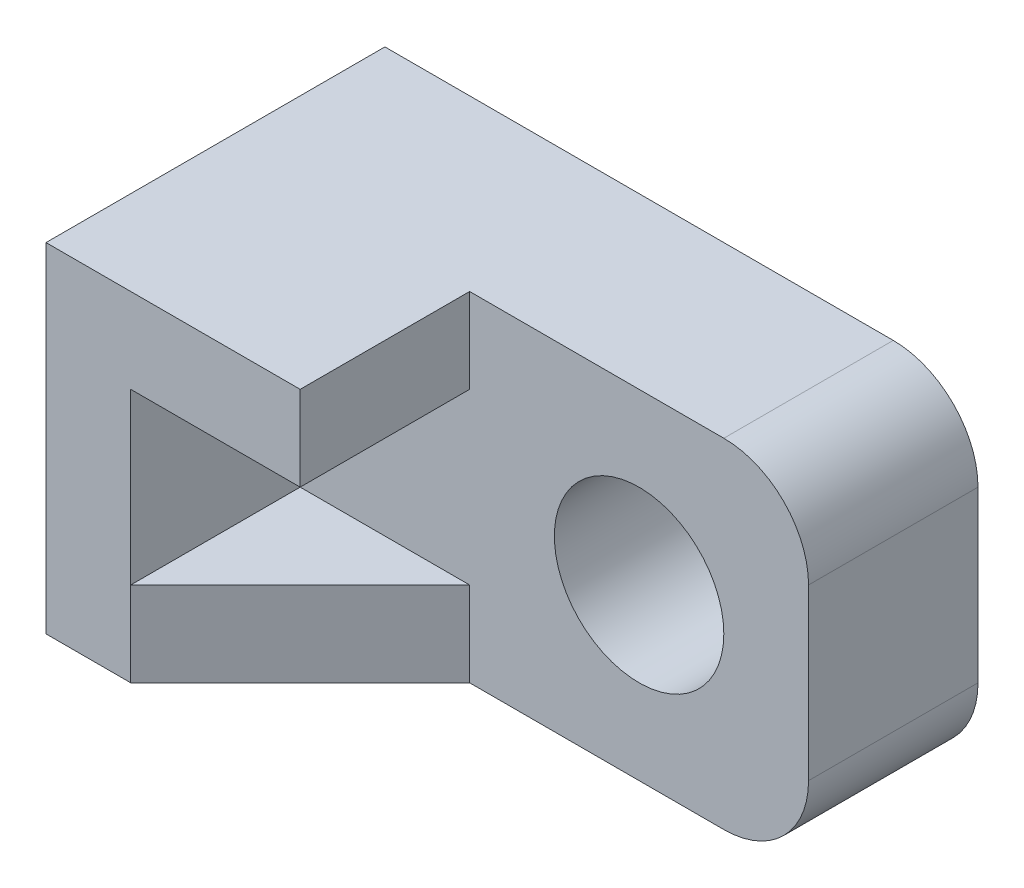
ISO-10303-21;
HEADER;
FILE_DESCRIPTION(('STEP AP214'),'2;1');
FILE_NAME('part.step','',(''),(''),'','','');
FILE_SCHEMA(('AUTOMOTIVE_DESIGN { 1 0 10303 214 1 1 1 1 }'));
ENDSEC;
DATA;
#1=APPLICATION_CONTEXT('core data for automotive mechanical design processes');
#2=APPLICATION_PROTOCOL_DEFINITION('international standard','automotive_design',2000,#1);
#3=PRODUCT_CONTEXT('',#1,'mechanical');
#4=PRODUCT('Part','Part','',(#3));
#5=PRODUCT_RELATED_PRODUCT_CATEGORY('part','',(#4));
#6=PRODUCT_DEFINITION_FORMATION('','',#4);
#7=PRODUCT_DEFINITION_CONTEXT('part definition',#1,'design');
#8=PRODUCT_DEFINITION('design','',#6,#7);
#9=PRODUCT_DEFINITION_SHAPE('','',#8);
#10=(LENGTH_UNIT() NAMED_UNIT(*) SI_UNIT(.MILLI.,.METRE.));
#11=(NAMED_UNIT(*) PLANE_ANGLE_UNIT() SI_UNIT($,.RADIAN.));
#12=(NAMED_UNIT(*) SI_UNIT($,.STERADIAN.) SOLID_ANGLE_UNIT());
#13=UNCERTAINTY_MEASURE_WITH_UNIT(LENGTH_MEASURE(1.E-05),#10,'distance_accuracy_value','');
#14=(GEOMETRIC_REPRESENTATION_CONTEXT(3) GLOBAL_UNCERTAINTY_ASSIGNED_CONTEXT((#13)) GLOBAL_UNIT_ASSIGNED_CONTEXT((#10,
#11,#12)) REPRESENTATION_CONTEXT('',''));
#15=CARTESIAN_POINT('',(0.,0.,0.));
#16=DIRECTION('',(0.,0.,1.));
#17=DIRECTION('',(1.,0.,0.));
#18=AXIS2_PLACEMENT_3D('',#15,#16,#17);
#19=CARTESIAN_POINT('',(0.,-1016.,1016.));
#20=DIRECTION('',(0.,1.,0.));
#21=DIRECTION('',(0.,0.,1.));
#22=AXIS2_PLACEMENT_3D('',#19,#20,#21);
#23=PLANE('',#22);
#24=DIRECTION('',(0.707106781186548,0.,-0.707106781186547));
#25=VECTOR('',#24,1.);
#26=CARTESIAN_POINT('',(254.,-1016.,1016.));
#27=LINE('',#26,#25);
#28=CARTESIAN_POINT('',(254.,-1016.,1016.));
#29=VERTEX_POINT('',#28);
#30=CARTESIAN_POINT('',(762.,-1016.,508.));
#31=VERTEX_POINT('',#30);
#32=EDGE_CURVE('E73',#29,#31,#27,.T.);
#33=ORIENTED_EDGE('',*,*,#32,.F.);
#34=DIRECTION('',(1.,0.,0.));
#35=VECTOR('',#34,1.);
#36=CARTESIAN_POINT('',(0.,-1016.,1016.));
#37=LINE('',#36,#35);
#38=CARTESIAN_POINT('',(1.24424114793371E-13,-1016.,1016.));
#39=VERTEX_POINT('',#38);
#40=EDGE_CURVE('E126',#39,#29,#37,.T.);
#41=ORIENTED_EDGE('',*,*,#40,.F.);
#42=DIRECTION('',(0.,0.,-1.));
#43=VECTOR('',#42,1.);
#44=CARTESIAN_POINT('',(1.24424114793371E-13,-1016.,1016.));
#45=LINE('',#44,#43);
#46=CARTESIAN_POINT('',(1.24424114793371E-13,-1016.,0.));
#47=VERTEX_POINT('',#46);
#48=EDGE_CURVE('E131',#39,#47,#45,.T.);
#49=ORIENTED_EDGE('',*,*,#48,.T.);
#50=DIRECTION('',(1.,0.,0.));
#51=VECTOR('',#50,1.);
#52=CARTESIAN_POINT('',(0.,-1016.,0.));
#53=LINE('',#52,#51);
#54=CARTESIAN_POINT('',(1524.,-1016.,0.));
#55=VERTEX_POINT('',#54);
#56=EDGE_CURVE('E137',#47,#55,#53,.T.);
#57=ORIENTED_EDGE('',*,*,#56,.T.);
#58=DIRECTION('',(0.,0.,-1.));
#59=VECTOR('',#58,1.);
#60=CARTESIAN_POINT('',(1524.,-1016.,508.));
#61=LINE('',#60,#59);
#62=CARTESIAN_POINT('',(1524.,-1016.,508.));
#63=VERTEX_POINT('',#62);
#64=EDGE_CURVE('E184',#63,#55,#61,.T.);
#65=ORIENTED_EDGE('',*,*,#64,.F.);
#66=DIRECTION('',(1.,0.,0.));
#67=VECTOR('',#66,1.);
#68=CARTESIAN_POINT('',(0.,-1016.,508.));
#69=LINE('',#68,#67);
#70=EDGE_CURVE('E232',#31,#63,#69,.T.);
#71=ORIENTED_EDGE('',*,*,#70,.F.);
#72=EDGE_LOOP('',(#33,#41,#49,#57,#65,#71));
#73=FACE_BOUND('',#72,.T.);
#74=ADVANCED_FACE('F35',(#73),#23,.F.);
#75=CARTESIAN_POINT('',(254.,0.,1016.));
#76=DIRECTION('',(1.,0.,0.));
#77=DIRECTION('',(0.,1.,0.));
#78=AXIS2_PLACEMENT_3D('',#75,#76,#77);
#79=PLANE('',#78);
#80=DIRECTION('',(0.,-1.,0.));
#81=VECTOR('',#80,1.);
#82=CARTESIAN_POINT('',(254.,0.,508.));
#83=LINE('',#82,#81);
#84=CARTESIAN_POINT('',(254.,-254.,508.));
#85=VERTEX_POINT('',#84);
#86=CARTESIAN_POINT('',(254.,-762.,508.));
#87=VERTEX_POINT('',#86);
#88=EDGE_CURVE('E151',#85,#87,#83,.T.);
#89=ORIENTED_EDGE('',*,*,#88,.F.);
#90=DIRECTION('',(0.,0.,-1.));
#91=VECTOR('',#90,1.);
#92=CARTESIAN_POINT('',(254.,-254.,1016.));
#93=LINE('',#92,#91);
#94=CARTESIAN_POINT('',(254.,-254.,1016.));
#95=VERTEX_POINT('',#94);
#96=EDGE_CURVE('E11',#95,#85,#93,.T.);
#97=ORIENTED_EDGE('',*,*,#96,.F.);
#98=DIRECTION('',(0.,-1.,0.));
#99=VECTOR('',#98,1.);
#100=CARTESIAN_POINT('',(254.,0.,1016.));
#101=LINE('',#100,#99);
#102=CARTESIAN_POINT('',(254.,-762.,1016.));
#103=VERTEX_POINT('',#102);
#104=EDGE_CURVE('E139',#95,#103,#101,.T.);
#105=ORIENTED_EDGE('',*,*,#104,.T.);
#106=DIRECTION('',(0.,0.,-1.));
#107=VECTOR('',#106,1.);
#108=CARTESIAN_POINT('',(254.,-762.,1016.));
#109=LINE('',#108,#107);
#110=EDGE_CURVE('E135',#103,#87,#109,.T.);
#111=ORIENTED_EDGE('',*,*,#110,.T.);
#112=EDGE_LOOP('',(#89,#97,#105,#111));
#113=FACE_BOUND('',#112,.T.);
#114=ADVANCED_FACE('F37',(#113),#79,.T.);
#115=CARTESIAN_POINT('',(0.,-254.,1016.));
#116=DIRECTION('',(0.,-1.,0.));
#117=DIRECTION('',(1.,0.,0.));
#118=AXIS2_PLACEMENT_3D('',#115,#116,#117);
#119=PLANE('',#118);
#120=DIRECTION('',(-1.,0.,0.));
#121=VECTOR('',#120,1.);
#122=CARTESIAN_POINT('',(0.,-254.,508.));
#123=LINE('',#122,#121);
#124=CARTESIAN_POINT('',(762.,-254.,508.));
#125=VERTEX_POINT('',#124);
#126=EDGE_CURVE('E148',#125,#85,#123,.T.);
#127=ORIENTED_EDGE('',*,*,#126,.F.);
#128=DIRECTION('',(0.,0.,-1.));
#129=VECTOR('',#128,1.);
#130=CARTESIAN_POINT('',(762.,-254.,1016.));
#131=LINE('',#130,#129);
#132=CARTESIAN_POINT('',(762.,-254.,1016.));
#133=VERTEX_POINT('',#132);
#134=EDGE_CURVE('E44',#133,#125,#131,.T.);
#135=ORIENTED_EDGE('',*,*,#134,.F.);
#136=DIRECTION('',(-1.,0.,0.));
#137=VECTOR('',#136,1.);
#138=CARTESIAN_POINT('',(0.,-254.,1016.));
#139=LINE('',#138,#137);
#140=EDGE_CURVE('E121',#133,#95,#139,.T.);
#141=ORIENTED_EDGE('',*,*,#140,.T.);
#142=ORIENTED_EDGE('',*,*,#96,.T.);
#143=EDGE_LOOP('',(#127,#135,#141,#142));
#144=FACE_BOUND('',#143,.T.);
#145=ADVANCED_FACE('F146',(#144),#119,.T.);
#146=CARTESIAN_POINT('',(762.,0.,1016.));
#147=DIRECTION('',(1.,0.,0.));
#148=DIRECTION('',(0.,0.,-1.));
#149=AXIS2_PLACEMENT_3D('',#146,#147,#148);
#150=PLANE('',#149);
#151=DIRECTION('',(0.,-1.,0.));
#152=VECTOR('',#151,1.);
#153=CARTESIAN_POINT('',(762.,0.,508.));
#154=LINE('',#153,#152);
#155=CARTESIAN_POINT('',(762.,0.,508.));
#156=VERTEX_POINT('',#155);
#157=EDGE_CURVE('E110',#156,#125,#154,.T.);
#158=ORIENTED_EDGE('',*,*,#157,.F.);
#159=DIRECTION('',(0.,0.,-1.));
#160=VECTOR('',#159,1.);
#161=CARTESIAN_POINT('',(762.,0.,1016.));
#162=LINE('',#161,#160);
#163=CARTESIAN_POINT('',(762.,0.,1016.));
#164=VERTEX_POINT('',#163);
#165=EDGE_CURVE('E103',#164,#156,#162,.T.);
#166=ORIENTED_EDGE('',*,*,#165,.F.);
#167=DIRECTION('',(0.,-1.,0.));
#168=VECTOR('',#167,1.);
#169=CARTESIAN_POINT('',(762.,0.,1016.));
#170=LINE('',#169,#168);
#171=EDGE_CURVE('E107',#164,#133,#170,.T.);
#172=ORIENTED_EDGE('',*,*,#171,.T.);
#173=ORIENTED_EDGE('',*,*,#134,.T.);
#174=EDGE_LOOP('',(#158,#166,#172,#173));
#175=FACE_BOUND('',#174,.T.);
#176=ADVANCED_FACE('F105',(#175),#150,.T.);
#177=CARTESIAN_POINT('',(0.,0.,1016.));
#178=DIRECTION('',(0.,1.,0.));
#179=DIRECTION('',(-1.,0.,0.));
#180=AXIS2_PLACEMENT_3D('',#177,#178,#179);
#181=PLANE('',#180);
#182=DIRECTION('',(1.,0.,0.));
#183=VECTOR('',#182,1.);
#184=CARTESIAN_POINT('',(0.,0.,0.));
#185=LINE('',#184,#183);
#186=CARTESIAN_POINT('',(0.,0.,0.));
#187=VERTEX_POINT('',#186);
#188=CARTESIAN_POINT('',(1524.,0.,0.));
#189=VERTEX_POINT('',#188);
#190=EDGE_CURVE('E132',#187,#189,#185,.T.);
#191=ORIENTED_EDGE('',*,*,#190,.F.);
#192=DIRECTION('',(0.,0.,-1.));
#193=VECTOR('',#192,1.);
#194=CARTESIAN_POINT('',(0.,0.,1016.));
#195=LINE('',#194,#193);
#196=CARTESIAN_POINT('',(0.,0.,1016.));
#197=VERTEX_POINT('',#196);
#198=EDGE_CURVE('E63',#197,#187,#195,.T.);
#199=ORIENTED_EDGE('',*,*,#198,.F.);
#200=DIRECTION('',(1.,0.,0.));
#201=VECTOR('',#200,1.);
#202=CARTESIAN_POINT('',(0.,0.,1016.));
#203=LINE('',#202,#201);
#204=EDGE_CURVE('E118',#197,#164,#203,.T.);
#205=ORIENTED_EDGE('',*,*,#204,.T.);
#206=ORIENTED_EDGE('',*,*,#165,.T.);
#207=DIRECTION('',(1.,0.,0.));
#208=VECTOR('',#207,1.);
#209=CARTESIAN_POINT('',(0.,0.,508.));
#210=LINE('',#209,#208);
#211=CARTESIAN_POINT('',(1524.,0.,508.));
#212=VERTEX_POINT('',#211);
#213=EDGE_CURVE('E155',#156,#212,#210,.T.);
#214=ORIENTED_EDGE('',*,*,#213,.T.);
#215=DIRECTION('',(0.,0.,-1.));
#216=VECTOR('',#215,1.);
#217=CARTESIAN_POINT('',(1524.,0.,508.));
#218=LINE('',#217,#216);
#219=EDGE_CURVE('E163',#212,#189,#218,.T.);
#220=ORIENTED_EDGE('',*,*,#219,.T.);
#221=EDGE_LOOP('',(#191,#199,#205,#206,#214,#220));
#222=FACE_BOUND('',#221,.T.);
#223=ADVANCED_FACE('F124',(#222),#181,.T.);
#224=CARTESIAN_POINT('',(0.,0.,1016.));
#225=DIRECTION('',(1.,0.,0.));
#226=DIRECTION('',(0.,1.,0.));
#227=AXIS2_PLACEMENT_3D('',#224,#225,#226);
#228=PLANE('',#227);
#229=DIRECTION('',(0.,-1.,0.));
#230=VECTOR('',#229,1.);
#231=CARTESIAN_POINT('',(0.,0.,0.));
#232=LINE('',#231,#230);
#233=EDGE_CURVE('E134',#187,#47,#232,.T.);
#234=ORIENTED_EDGE('',*,*,#233,.T.);
#235=ORIENTED_EDGE('',*,*,#48,.F.);
#236=DIRECTION('',(0.,-1.,0.));
#237=VECTOR('',#236,1.);
#238=CARTESIAN_POINT('',(0.,0.,1016.));
#239=LINE('',#238,#237);
#240=EDGE_CURVE('E52',#197,#39,#239,.T.);
#241=ORIENTED_EDGE('',*,*,#240,.F.);
#242=ORIENTED_EDGE('',*,*,#198,.T.);
#243=EDGE_LOOP('',(#234,#235,#241,#242));
#244=FACE_BOUND('',#243,.T.);
#245=ADVANCED_FACE('F263',(#244),#228,.F.);
#246=CARTESIAN_POINT('',(0.,0.,1016.));
#247=DIRECTION('',(0.,0.,1.));
#248=DIRECTION('',(1.,0.,0.));
#249=AXIS2_PLACEMENT_3D('',#246,#247,#248);
#250=PLANE('',#249);
#251=DIRECTION('',(0.,-1.,0.));
#252=VECTOR('',#251,1.);
#253=CARTESIAN_POINT('',(254.,2730.5,1016.));
#254=LINE('',#253,#252);
#255=EDGE_CURVE('E195',#103,#29,#254,.T.);
#256=ORIENTED_EDGE('',*,*,#255,.F.);
#257=ORIENTED_EDGE('',*,*,#104,.F.);
#258=ORIENTED_EDGE('',*,*,#140,.F.);
#259=ORIENTED_EDGE('',*,*,#171,.F.);
#260=ORIENTED_EDGE('',*,*,#204,.F.);
#261=ORIENTED_EDGE('',*,*,#240,.T.);
#262=ORIENTED_EDGE('',*,*,#40,.T.);
#263=EDGE_LOOP('',(#256,#257,#258,#259,#260,#261,#262));
#264=FACE_BOUND('',#263,.T.);
#265=ADVANCED_FACE('F117',(#264),#250,.T.);
#266=CARTESIAN_POINT('',(0.,0.,0.));
#267=DIRECTION('',(0.,0.,1.));
#268=DIRECTION('',(1.,0.,0.));
#269=AXIS2_PLACEMENT_3D('',#266,#267,#268);
#270=PLANE('',#269);
#271=CARTESIAN_POINT('',(1524.,-762.,0.));
#272=DIRECTION('',(0.,0.,1.));
#273=DIRECTION('',(1.,0.,0.));
#274=AXIS2_PLACEMENT_3D('',#271,#272,#273);
#275=CIRCLE('',#274,254.);
#276=CARTESIAN_POINT('',(1778.,-762.,0.));
#277=VERTEX_POINT('',#276);
#278=EDGE_CURVE('E167',#55,#277,#275,.T.);
#279=ORIENTED_EDGE('',*,*,#278,.F.);
#280=ORIENTED_EDGE('',*,*,#56,.F.);
#281=ORIENTED_EDGE('',*,*,#233,.F.);
#282=ORIENTED_EDGE('',*,*,#190,.T.);
#283=CARTESIAN_POINT('',(1524.,-254.,0.));
#284=DIRECTION('',(0.,0.,1.));
#285=DIRECTION('',(1.,0.,0.));
#286=AXIS2_PLACEMENT_3D('',#283,#284,#285);
#287=CIRCLE('',#286,254.);
#288=CARTESIAN_POINT('',(1778.,-254.,0.));
#289=VERTEX_POINT('',#288);
#290=EDGE_CURVE('E174',#289,#189,#287,.T.);
#291=ORIENTED_EDGE('',*,*,#290,.F.);
#292=DIRECTION('',(0.,-1.,0.));
#293=VECTOR('',#292,1.);
#294=CARTESIAN_POINT('',(1778.,-7.7715611723761E-13,0.));
#295=LINE('',#294,#293);
#296=EDGE_CURVE('E171',#289,#277,#295,.T.);
#297=ORIENTED_EDGE('',*,*,#296,.T.);
#298=EDGE_LOOP('',(#279,#280,#281,#282,#291,#297));
#299=FACE_BOUND('',#298,.T.);
#300=CARTESIAN_POINT('',(1270.,-508.,0.));
#301=DIRECTION('',(0.,0.,1.));
#302=DIRECTION('',(1.,0.,0.));
#303=AXIS2_PLACEMENT_3D('',#300,#301,#302);
#304=CIRCLE('',#303,254.);
#305=CARTESIAN_POINT('',(1524.,-508.,0.));
#306=VERTEX_POINT('',#305);
#307=EDGE_CURVE('E164',#306,#306,#304,.T.);
#308=ORIENTED_EDGE('',*,*,#307,.T.);
#309=EDGE_LOOP('',(#308));
#310=FACE_BOUND('',#309,.T.);
#311=ADVANCED_FACE('F261',(#299,#310),#270,.F.);
#312=CARTESIAN_POINT('',(0.,-762.,1016.));
#313=DIRECTION('',(0.,1.,0.));
#314=DIRECTION('',(0.,0.,1.));
#315=AXIS2_PLACEMENT_3D('',#312,#313,#314);
#316=PLANE('',#315);
#317=DIRECTION('',(0.707106781186548,0.,-0.707106781186547));
#318=VECTOR('',#317,1.);
#319=CARTESIAN_POINT('',(254.,-762.,1016.));
#320=LINE('',#319,#318);
#321=CARTESIAN_POINT('',(762.,-762.,508.));
#322=VERTEX_POINT('',#321);
#323=EDGE_CURVE('E168',#103,#322,#320,.T.);
#324=ORIENTED_EDGE('',*,*,#323,.T.);
#325=DIRECTION('',(1.,0.,0.));
#326=VECTOR('',#325,1.);
#327=CARTESIAN_POINT('',(0.,-762.,508.));
#328=LINE('',#327,#326);
#329=EDGE_CURVE('E153',#87,#322,#328,.T.);
#330=ORIENTED_EDGE('',*,*,#329,.F.);
#331=ORIENTED_EDGE('',*,*,#110,.F.);
#332=EDGE_LOOP('',(#324,#330,#331));
#333=FACE_BOUND('',#332,.T.);
#334=ADVANCED_FACE('F202',(#333),#316,.T.);
#335=CARTESIAN_POINT('',(1524.,-762.,508.));
#336=DIRECTION('',(0.,0.,-1.));
#337=DIRECTION('',(-1.,0.,0.));
#338=AXIS2_PLACEMENT_3D('',#335,#336,#337);
#339=CYLINDRICAL_SURFACE('',#338,254.);
#340=ORIENTED_EDGE('',*,*,#278,.T.);
#341=DIRECTION('',(0.,0.,-1.));
#342=VECTOR('',#341,1.);
#343=CARTESIAN_POINT('',(1778.,-762.,508.));
#344=LINE('',#343,#342);
#345=CARTESIAN_POINT('',(1778.,-762.,508.));
#346=VERTEX_POINT('',#345);
#347=EDGE_CURVE('E182',#346,#277,#344,.T.);
#348=ORIENTED_EDGE('',*,*,#347,.F.);
#349=CARTESIAN_POINT('',(1524.,-762.,508.));
#350=DIRECTION('',(0.,0.,1.));
#351=DIRECTION('',(1.,0.,0.));
#352=AXIS2_PLACEMENT_3D('',#349,#350,#351);
#353=CIRCLE('',#352,254.);
#354=EDGE_CURVE('E230',#63,#346,#353,.T.);
#355=ORIENTED_EDGE('',*,*,#354,.F.);
#356=ORIENTED_EDGE('',*,*,#64,.T.);
#357=EDGE_LOOP('',(#340,#348,#355,#356));
#358=FACE_BOUND('',#357,.T.);
#359=ADVANCED_FACE('F304',(#358),#339,.T.);
#360=CARTESIAN_POINT('',(1778.,-7.7715611723761E-13,508.));
#361=DIRECTION('',(1.,0.,0.));
#362=DIRECTION('',(0.,1.,0.));
#363=AXIS2_PLACEMENT_3D('',#360,#361,#362);
#364=PLANE('',#363);
#365=ORIENTED_EDGE('',*,*,#296,.F.);
#366=DIRECTION('',(0.,0.,-1.));
#367=VECTOR('',#366,1.);
#368=CARTESIAN_POINT('',(1778.,-254.,508.));
#369=LINE('',#368,#367);
#370=CARTESIAN_POINT('',(1778.,-254.,508.));
#371=VERTEX_POINT('',#370);
#372=EDGE_CURVE('E180',#371,#289,#369,.T.);
#373=ORIENTED_EDGE('',*,*,#372,.F.);
#374=DIRECTION('',(0.,-1.,0.));
#375=VECTOR('',#374,1.);
#376=CARTESIAN_POINT('',(1778.,-7.7715611723761E-13,508.));
#377=LINE('',#376,#375);
#378=EDGE_CURVE('E225',#371,#346,#377,.T.);
#379=ORIENTED_EDGE('',*,*,#378,.T.);
#380=ORIENTED_EDGE('',*,*,#347,.T.);
#381=EDGE_LOOP('',(#365,#373,#379,#380));
#382=FACE_BOUND('',#381,.T.);
#383=ADVANCED_FACE('F310',(#382),#364,.T.);
#384=CARTESIAN_POINT('',(1524.,-254.,508.));
#385=DIRECTION('',(0.,0.,-1.));
#386=DIRECTION('',(-1.,0.,0.));
#387=AXIS2_PLACEMENT_3D('',#384,#385,#386);
#388=CYLINDRICAL_SURFACE('',#387,254.);
#389=ORIENTED_EDGE('',*,*,#290,.T.);
#390=ORIENTED_EDGE('',*,*,#219,.F.);
#391=CARTESIAN_POINT('',(1524.,-254.,508.));
#392=DIRECTION('',(0.,0.,1.));
#393=DIRECTION('',(1.,0.,0.));
#394=AXIS2_PLACEMENT_3D('',#391,#392,#393);
#395=CIRCLE('',#394,254.);
#396=EDGE_CURVE('E223',#371,#212,#395,.T.);
#397=ORIENTED_EDGE('',*,*,#396,.F.);
#398=ORIENTED_EDGE('',*,*,#372,.T.);
#399=EDGE_LOOP('',(#389,#390,#397,#398));
#400=FACE_BOUND('',#399,.T.);
#401=ADVANCED_FACE('F250',(#400),#388,.T.);
#402=CARTESIAN_POINT('',(1270.,-508.,508.));
#403=DIRECTION('',(0.,0.,-1.));
#404=DIRECTION('',(-1.,0.,0.));
#405=AXIS2_PLACEMENT_3D('',#402,#403,#404);
#406=CYLINDRICAL_SURFACE('',#405,254.);
#407=CARTESIAN_POINT('',(1270.,-508.,508.));
#408=DIRECTION('',(0.,0.,1.));
#409=DIRECTION('',(1.,0.,0.));
#410=AXIS2_PLACEMENT_3D('',#407,#408,#409);
#411=CIRCLE('',#410,254.);
#412=CARTESIAN_POINT('',(1524.,-508.,508.));
#413=VERTEX_POINT('',#412);
#414=EDGE_CURVE('E177',#413,#413,#411,.T.);
#415=ORIENTED_EDGE('',*,*,#414,.T.);
#416=EDGE_LOOP('',(#415));
#417=FACE_BOUND('',#416,.T.);
#418=ORIENTED_EDGE('',*,*,#307,.F.);
#419=EDGE_LOOP('',(#418));
#420=FACE_BOUND('',#419,.T.);
#421=ADVANCED_FACE('F239',(#417,#420),#406,.F.);
#422=CARTESIAN_POINT('',(0.,0.,508.));
#423=DIRECTION('',(0.,0.,1.));
#424=DIRECTION('',(1.,0.,0.));
#425=AXIS2_PLACEMENT_3D('',#422,#423,#424);
#426=PLANE('',#425);
#427=ORIENTED_EDGE('',*,*,#414,.F.);
#428=EDGE_LOOP('',(#427));
#429=FACE_BOUND('',#428,.T.);
#430=ORIENTED_EDGE('',*,*,#70,.T.);
#431=ORIENTED_EDGE('',*,*,#354,.T.);
#432=ORIENTED_EDGE('',*,*,#378,.F.);
#433=ORIENTED_EDGE('',*,*,#396,.T.);
#434=ORIENTED_EDGE('',*,*,#213,.F.);
#435=ORIENTED_EDGE('',*,*,#157,.T.);
#436=ORIENTED_EDGE('',*,*,#126,.T.);
#437=ORIENTED_EDGE('',*,*,#88,.T.);
#438=ORIENTED_EDGE('',*,*,#329,.T.);
#439=DIRECTION('',(0.,-1.,0.));
#440=VECTOR('',#439,1.);
#441=CARTESIAN_POINT('',(762.,0.,508.));
#442=LINE('',#441,#440);
#443=EDGE_CURVE('E161',#322,#31,#442,.T.);
#444=ORIENTED_EDGE('',*,*,#443,.T.);
#445=EDGE_LOOP('',(#430,#431,#432,#433,#434,#435,#436,#437,#438,#444));
#446=FACE_BOUND('',#445,.T.);
#447=ADVANCED_FACE('F204',(#429,#446),#426,.T.);
#448=CARTESIAN_POINT('',(254.,2730.5,1016.));
#449=DIRECTION('',(-0.707106781186547,0.,-0.707106781186548));
#450=DIRECTION('',(-0.707106781186548,0.,0.707106781186547));
#451=AXIS2_PLACEMENT_3D('',#448,#449,#450);
#452=PLANE('',#451);
#453=ORIENTED_EDGE('',*,*,#255,.T.);
#454=ORIENTED_EDGE('',*,*,#32,.T.);
#455=ORIENTED_EDGE('',*,*,#443,.F.);
#456=ORIENTED_EDGE('',*,*,#323,.F.);
#457=EDGE_LOOP('',(#453,#454,#455,#456));
#458=FACE_BOUND('',#457,.T.);
#459=ADVANCED_FACE('F243',(#458),#452,.F.);
#460=CLOSED_SHELL('',(#74,#114,#145,#176,#223,#245,#265,#311,#334,#359,#383,#401,#421,#447,#459));
#461=MANIFOLD_SOLID_BREP('B2',#460);
#462=ADVANCED_BREP_SHAPE_REPRESENTATION('',(#18,#461),#14);
#463=SHAPE_DEFINITION_REPRESENTATION(#9,#462);
ENDSEC;
END-ISO-10303-21;
